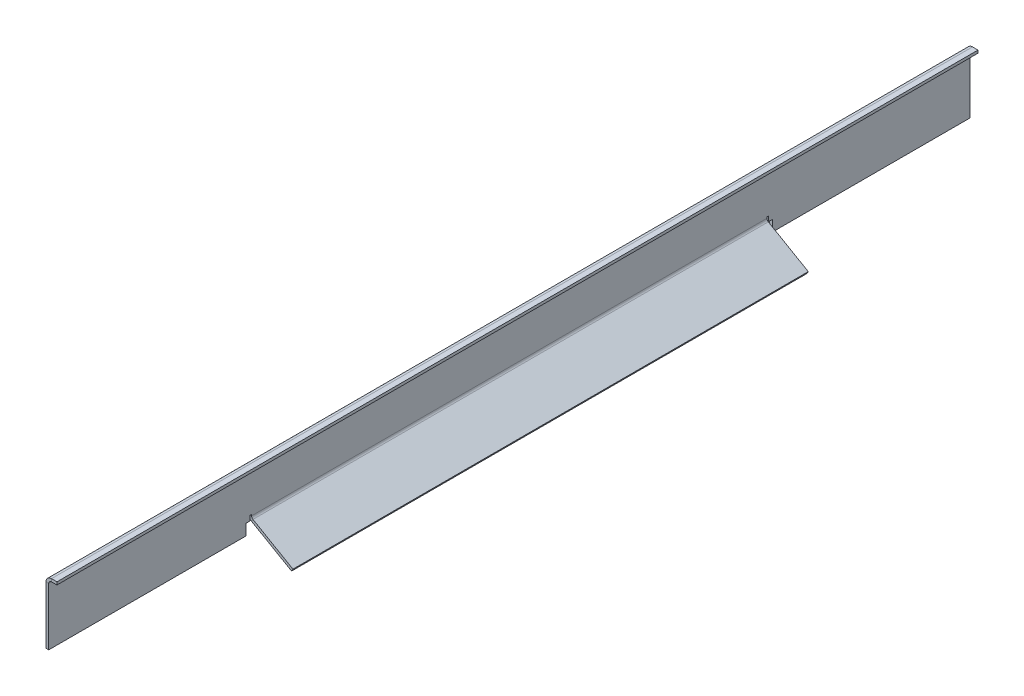
ISO-10303-21;
HEADER;
FILE_DESCRIPTION(('STEP AP214'),'2;1');
FILE_NAME('part.step','',(''),(''),'','','');
FILE_SCHEMA(('AUTOMOTIVE_DESIGN { 1 0 10303 214 1 1 1 1 }'));
ENDSEC;
DATA;
#1=APPLICATION_CONTEXT('core data for automotive mechanical design processes');
#2=APPLICATION_PROTOCOL_DEFINITION('international standard','automotive_design',2000,#1);
#3=PRODUCT_CONTEXT('',#1,'mechanical');
#4=PRODUCT('Part','Part','',(#3));
#5=PRODUCT_RELATED_PRODUCT_CATEGORY('part','',(#4));
#6=PRODUCT_DEFINITION_FORMATION('','',#4);
#7=PRODUCT_DEFINITION_CONTEXT('part definition',#1,'design');
#8=PRODUCT_DEFINITION('design','',#6,#7);
#9=PRODUCT_DEFINITION_SHAPE('','',#8);
#10=(LENGTH_UNIT() NAMED_UNIT(*) SI_UNIT(.MILLI.,.METRE.));
#11=(NAMED_UNIT(*) PLANE_ANGLE_UNIT() SI_UNIT($,.RADIAN.));
#12=(NAMED_UNIT(*) SI_UNIT($,.STERADIAN.) SOLID_ANGLE_UNIT());
#13=UNCERTAINTY_MEASURE_WITH_UNIT(LENGTH_MEASURE(1.E-05),#10,'distance_accuracy_value','');
#14=(GEOMETRIC_REPRESENTATION_CONTEXT(3) GLOBAL_UNCERTAINTY_ASSIGNED_CONTEXT((#13)) GLOBAL_UNIT_ASSIGNED_CONTEXT((#10,
#11,#12)) REPRESENTATION_CONTEXT('',''));
#15=CARTESIAN_POINT('',(0.,0.,0.));
#16=DIRECTION('',(0.,0.,1.));
#17=DIRECTION('',(1.,0.,0.));
#18=AXIS2_PLACEMENT_3D('',#15,#16,#17);
#19=CARTESIAN_POINT('',(-3.175,0.,0.));
#20=DIRECTION('',(-1.,0.,0.));
#21=DIRECTION('',(0.,0.,1.));
#22=AXIS2_PLACEMENT_3D('',#19,#20,#21);
#23=PLANE('',#22);
#24=DIRECTION('',(0.,-1.,0.));
#25=VECTOR('',#24,1.);
#26=CARTESIAN_POINT('',(-3.175,0.,0.));
#27=LINE('',#26,#25);
#28=CARTESIAN_POINT('',(-3.17500000000001,66.675,0.));
#29=VERTEX_POINT('',#28);
#30=CARTESIAN_POINT('',(-3.175,0.,0.));
#31=VERTEX_POINT('',#30);
#32=EDGE_CURVE('E402',#29,#31,#27,.T.);
#33=ORIENTED_EDGE('',*,*,#32,.F.);
#34=DIRECTION('',(0.,0.,1.));
#35=VECTOR('',#34,1.);
#36=CARTESIAN_POINT('',(-3.17500000000001,66.675,0.));
#37=LINE('',#36,#35);
#38=CARTESIAN_POINT('',(-3.175,66.675,-1066.8));
#39=VERTEX_POINT('',#38);
#40=EDGE_CURVE('E283',#29,#39,#37,.F.);
#41=ORIENTED_EDGE('',*,*,#40,.T.);
#42=DIRECTION('',(0.,1.,0.));
#43=VECTOR('',#42,1.);
#44=CARTESIAN_POINT('',(-3.175,0.,-1066.8));
#45=LINE('',#44,#43);
#46=CARTESIAN_POINT('',(-3.175,0.,-1066.8));
#47=VERTEX_POINT('',#46);
#48=EDGE_CURVE('E422',#47,#39,#45,.T.);
#49=ORIENTED_EDGE('',*,*,#48,.F.);
#50=DIRECTION('',(0.,0.,-1.));
#51=VECTOR('',#50,1.);
#52=CARTESIAN_POINT('',(-3.175,0.,-838.2));
#53=LINE('',#52,#51);
#54=CARTESIAN_POINT('',(-3.175,0.,-838.2));
#55=VERTEX_POINT('',#54);
#56=EDGE_CURVE('E419',#55,#47,#53,.T.);
#57=ORIENTED_EDGE('',*,*,#56,.F.);
#58=DIRECTION('',(0.,-1.,0.));
#59=VECTOR('',#58,1.);
#60=CARTESIAN_POINT('',(-3.175,0.,-838.2));
#61=LINE('',#60,#59);
#62=CARTESIAN_POINT('',(-3.175,12.7,-838.2));
#63=VERTEX_POINT('',#62);
#64=EDGE_CURVE('E416',#63,#55,#61,.T.);
#65=ORIENTED_EDGE('',*,*,#64,.F.);
#66=DIRECTION('',(0.,0.,-1.));
#67=VECTOR('',#66,1.);
#68=CARTESIAN_POINT('',(-3.175,12.7000000000004,-831.85));
#69=LINE('',#68,#67);
#70=CARTESIAN_POINT('',(-3.175,12.7000000000003,-833.4375));
#71=VERTEX_POINT('',#70);
#72=EDGE_CURVE('E414',#71,#63,#69,.T.);
#73=ORIENTED_EDGE('',*,*,#72,.F.);
#74=DIRECTION('',(0.,1.,0.));
#75=VECTOR('',#74,1.);
#76=CARTESIAN_POINT('',(-3.175,0.,-833.4375));
#77=LINE('',#76,#75);
#78=CARTESIAN_POINT('',(-3.175,18.5167613140312,-833.4375));
#79=VERTEX_POINT('',#78);
#80=EDGE_CURVE('E96',#71,#79,#77,.T.);
#81=ORIENTED_EDGE('',*,*,#80,.T.);
#82=DIRECTION('',(0.,0.,1.));
#83=VECTOR('',#82,1.);
#84=CARTESIAN_POINT('',(-3.175,18.5167613140312,0.));
#85=LINE('',#84,#83);
#86=CARTESIAN_POINT('',(-3.175,18.5167613140312,-831.85));
#87=VERTEX_POINT('',#86);
#88=EDGE_CURVE('E100',#79,#87,#85,.T.);
#89=ORIENTED_EDGE('',*,*,#88,.T.);
#90=DIRECTION('',(0.,-1.,0.));
#91=VECTOR('',#90,1.);
#92=CARTESIAN_POINT('',(-3.175,0.,-831.85));
#93=LINE('',#92,#91);
#94=CARTESIAN_POINT('',(-3.17499999999985,16.9292613140311,-831.85));
#95=VERTEX_POINT('',#94);
#96=EDGE_CURVE('E395',#87,#95,#93,.T.);
#97=ORIENTED_EDGE('',*,*,#96,.T.);
#98=DIRECTION('',(0.,0.,-1.));
#99=VECTOR('',#98,1.);
#100=CARTESIAN_POINT('',(-3.17499999999985,16.9292613140311,-831.85));
#101=LINE('',#100,#99);
#102=CARTESIAN_POINT('',(-3.175,16.9292613140312,-234.95));
#103=VERTEX_POINT('',#102);
#104=EDGE_CURVE('E337',#95,#103,#101,.F.);
#105=ORIENTED_EDGE('',*,*,#104,.T.);
#106=DIRECTION('',(0.,1.,0.));
#107=VECTOR('',#106,1.);
#108=CARTESIAN_POINT('',(-3.175,0.,-234.95));
#109=LINE('',#108,#107);
#110=CARTESIAN_POINT('',(-3.175,18.5167613140312,-234.95));
#111=VERTEX_POINT('',#110);
#112=EDGE_CURVE('E393',#103,#111,#109,.T.);
#113=ORIENTED_EDGE('',*,*,#112,.T.);
#114=DIRECTION('',(0.,0.,1.));
#115=VECTOR('',#114,1.);
#116=CARTESIAN_POINT('',(-3.175,18.5167613140312,0.));
#117=LINE('',#116,#115);
#118=CARTESIAN_POINT('',(-3.175,18.5167613140312,-233.3625));
#119=VERTEX_POINT('',#118);
#120=EDGE_CURVE('E391',#111,#119,#117,.T.);
#121=ORIENTED_EDGE('',*,*,#120,.T.);
#122=DIRECTION('',(0.,-1.,0.));
#123=VECTOR('',#122,1.);
#124=CARTESIAN_POINT('',(-3.175,0.,-233.3625));
#125=LINE('',#124,#123);
#126=CARTESIAN_POINT('',(-3.175,12.7,-233.3625));
#127=VERTEX_POINT('',#126);
#128=EDGE_CURVE('E363',#119,#127,#125,.T.);
#129=ORIENTED_EDGE('',*,*,#128,.T.);
#130=DIRECTION('',(0.,0.,-1.));
#131=VECTOR('',#130,1.);
#132=CARTESIAN_POINT('',(-3.175,12.7,-228.6));
#133=LINE('',#132,#131);
#134=CARTESIAN_POINT('',(-3.175,12.7,-228.6));
#135=VERTEX_POINT('',#134);
#136=EDGE_CURVE('E411',#135,#127,#133,.T.);
#137=ORIENTED_EDGE('',*,*,#136,.F.);
#138=DIRECTION('',(0.,1.,0.));
#139=VECTOR('',#138,1.);
#140=CARTESIAN_POINT('',(-3.175,0.,-228.6));
#141=LINE('',#140,#139);
#142=CARTESIAN_POINT('',(-3.175,0.,-228.6));
#143=VERTEX_POINT('',#142);
#144=EDGE_CURVE('E408',#143,#135,#141,.T.);
#145=ORIENTED_EDGE('',*,*,#144,.F.);
#146=DIRECTION('',(0.,0.,-1.));
#147=VECTOR('',#146,1.);
#148=CARTESIAN_POINT('',(-3.175,0.,0.));
#149=LINE('',#148,#147);
#150=EDGE_CURVE('E404',#31,#143,#149,.T.);
#151=ORIENTED_EDGE('',*,*,#150,.F.);
#152=EDGE_LOOP('',(#33,#41,#49,#57,#65,#73,#81,#89,#97,#105,#113,#121,#129,#137,#145,#151));
#153=FACE_BOUND('',#152,.T.);
#154=ADVANCED_FACE('F81',(#153),#23,.T.);
#155=CARTESIAN_POINT('',(0.,0.,0.));
#156=DIRECTION('',(-1.,0.,0.));
#157=DIRECTION('',(0.,0.,1.));
#158=AXIS2_PLACEMENT_3D('',#155,#156,#157);
#159=PLANE('',#158);
#160=DIRECTION('',(0.,0.,1.));
#161=VECTOR('',#160,1.);
#162=CARTESIAN_POINT('',(0.,66.675,0.));
#163=LINE('',#162,#161);
#164=CARTESIAN_POINT('',(0.,66.675,0.));
#165=VERTEX_POINT('',#164);
#166=CARTESIAN_POINT('',(0.,66.675,-1066.8));
#167=VERTEX_POINT('',#166);
#168=EDGE_CURVE('E296',#165,#167,#163,.F.);
#169=ORIENTED_EDGE('',*,*,#168,.F.);
#170=DIRECTION('',(0.,-1.,0.));
#171=VECTOR('',#170,1.);
#172=CARTESIAN_POINT('',(0.,0.,0.));
#173=LINE('',#172,#171);
#174=CARTESIAN_POINT('',(0.,0.,0.));
#175=VERTEX_POINT('',#174);
#176=EDGE_CURVE('E401',#165,#175,#173,.T.);
#177=ORIENTED_EDGE('',*,*,#176,.T.);
#178=DIRECTION('',(0.,0.,-1.));
#179=VECTOR('',#178,1.);
#180=CARTESIAN_POINT('',(0.,0.,0.));
#181=LINE('',#180,#179);
#182=CARTESIAN_POINT('',(0.,0.,-228.6));
#183=VERTEX_POINT('',#182);
#184=EDGE_CURVE('E427',#175,#183,#181,.T.);
#185=ORIENTED_EDGE('',*,*,#184,.T.);
#186=DIRECTION('',(0.,1.,0.));
#187=VECTOR('',#186,1.);
#188=CARTESIAN_POINT('',(0.,0.,-228.6));
#189=LINE('',#188,#187);
#190=CARTESIAN_POINT('',(0.,12.7,-228.6));
#191=VERTEX_POINT('',#190);
#192=EDGE_CURVE('E430',#183,#191,#189,.T.);
#193=ORIENTED_EDGE('',*,*,#192,.T.);
#194=DIRECTION('',(0.,0.,-1.));
#195=VECTOR('',#194,1.);
#196=CARTESIAN_POINT('',(0.,12.7,-228.6));
#197=LINE('',#196,#195);
#198=CARTESIAN_POINT('',(0.,12.7,-233.3625));
#199=VERTEX_POINT('',#198);
#200=EDGE_CURVE('E433',#191,#199,#197,.T.);
#201=ORIENTED_EDGE('',*,*,#200,.T.);
#202=DIRECTION('',(0.,-1.,0.));
#203=VECTOR('',#202,1.);
#204=CARTESIAN_POINT('',(0.,18.5167613140312,-233.3625));
#205=LINE('',#204,#203);
#206=CARTESIAN_POINT('',(0.,18.5167613140312,-233.3625));
#207=VERTEX_POINT('',#206);
#208=EDGE_CURVE('E376',#207,#199,#205,.T.);
#209=ORIENTED_EDGE('',*,*,#208,.F.);
#210=DIRECTION('',(0.,0.,1.));
#211=VECTOR('',#210,1.);
#212=CARTESIAN_POINT('',(0.,18.5167613140312,-234.95));
#213=LINE('',#212,#211);
#214=CARTESIAN_POINT('',(0.,18.5167613140312,-234.95));
#215=VERTEX_POINT('',#214);
#216=EDGE_CURVE('E372',#215,#207,#213,.T.);
#217=ORIENTED_EDGE('',*,*,#216,.F.);
#218=DIRECTION('',(0.,1.,0.));
#219=VECTOR('',#218,1.);
#220=CARTESIAN_POINT('',(0.,16.9292613140312,-234.95));
#221=LINE('',#220,#219);
#222=CARTESIAN_POINT('',(0.,16.9292613140312,-234.95));
#223=VERTEX_POINT('',#222);
#224=EDGE_CURVE('E369',#223,#215,#221,.T.);
#225=ORIENTED_EDGE('',*,*,#224,.F.);
#226=DIRECTION('',(0.,0.,-1.));
#227=VECTOR('',#226,1.);
#228=CARTESIAN_POINT('',(1.53523027623947E-13,16.9292613140312,-831.85));
#229=LINE('',#228,#227);
#230=CARTESIAN_POINT('',(1.53523027623947E-13,16.9292613140312,-831.85));
#231=VERTEX_POINT('',#230);
#232=EDGE_CURVE('E350',#231,#223,#229,.F.);
#233=ORIENTED_EDGE('',*,*,#232,.F.);
#234=DIRECTION('',(0.,-1.,0.));
#235=VECTOR('',#234,1.);
#236=CARTESIAN_POINT('',(1.53523027623947E-13,18.5167613140312,-831.85));
#237=LINE('',#236,#235);
#238=CARTESIAN_POINT('',(0.,18.5167613140312,-831.85));
#239=VERTEX_POINT('',#238);
#240=EDGE_CURVE('E365',#239,#231,#237,.T.);
#241=ORIENTED_EDGE('',*,*,#240,.F.);
#242=DIRECTION('',(0.,0.,1.));
#243=VECTOR('',#242,1.);
#244=CARTESIAN_POINT('',(1.53523027623947E-13,18.5167613140312,-833.4375));
#245=LINE('',#244,#243);
#246=CARTESIAN_POINT('',(0.,18.5167613140312,-833.4375));
#247=VERTEX_POINT('',#246);
#248=EDGE_CURVE('E360',#247,#239,#245,.T.);
#249=ORIENTED_EDGE('',*,*,#248,.F.);
#250=DIRECTION('',(0.,1.,0.));
#251=VECTOR('',#250,1.);
#252=CARTESIAN_POINT('',(0.,0.,-833.4375));
#253=LINE('',#252,#251);
#254=CARTESIAN_POINT('',(0.,12.7000000000003,-833.4375));
#255=VERTEX_POINT('',#254);
#256=EDGE_CURVE('E13',#255,#247,#253,.T.);
#257=ORIENTED_EDGE('',*,*,#256,.F.);
#258=DIRECTION('',(0.,0.,-1.));
#259=VECTOR('',#258,1.);
#260=CARTESIAN_POINT('',(0.,12.7000000000004,-831.85));
#261=LINE('',#260,#259);
#262=CARTESIAN_POINT('',(0.,12.7,-838.2));
#263=VERTEX_POINT('',#262);
#264=EDGE_CURVE('E435',#255,#263,#261,.T.);
#265=ORIENTED_EDGE('',*,*,#264,.T.);
#266=DIRECTION('',(0.,-1.,0.));
#267=VECTOR('',#266,1.);
#268=CARTESIAN_POINT('',(0.,0.,-838.2));
#269=LINE('',#268,#267);
#270=CARTESIAN_POINT('',(0.,0.,-838.2));
#271=VERTEX_POINT('',#270);
#272=EDGE_CURVE('E437',#263,#271,#269,.T.);
#273=ORIENTED_EDGE('',*,*,#272,.T.);
#274=DIRECTION('',(0.,0.,-1.));
#275=VECTOR('',#274,1.);
#276=CARTESIAN_POINT('',(0.,0.,-838.2));
#277=LINE('',#276,#275);
#278=CARTESIAN_POINT('',(0.,0.,-1066.8));
#279=VERTEX_POINT('',#278);
#280=EDGE_CURVE('E440',#271,#279,#277,.T.);
#281=ORIENTED_EDGE('',*,*,#280,.T.);
#282=DIRECTION('',(0.,1.,0.));
#283=VECTOR('',#282,1.);
#284=CARTESIAN_POINT('',(0.,0.,-1066.8));
#285=LINE('',#284,#283);
#286=EDGE_CURVE('E405',#279,#167,#285,.T.);
#287=ORIENTED_EDGE('',*,*,#286,.T.);
#288=EDGE_LOOP('',(#169,#177,#185,#193,#201,#209,#217,#225,#233,#241,#249,#257,#265,#273,#281,#287));
#289=FACE_BOUND('',#288,.T.);
#290=ADVANCED_FACE('F466',(#289),#159,.F.);
#291=CARTESIAN_POINT('',(-3.175,0.,0.));
#292=DIRECTION('',(0.,0.,1.));
#293=DIRECTION('',(1.,0.,0.));
#294=AXIS2_PLACEMENT_3D('',#291,#292,#293);
#295=PLANE('',#294);
#296=ORIENTED_EDGE('',*,*,#176,.F.);
#297=DIRECTION('',(-1.,0.,0.));
#298=VECTOR('',#297,1.);
#299=CARTESIAN_POINT('',(0.,66.675,0.));
#300=LINE('',#299,#298);
#301=EDGE_CURVE('E290',#165,#29,#300,.T.);
#302=ORIENTED_EDGE('',*,*,#301,.T.);
#303=ORIENTED_EDGE('',*,*,#32,.T.);
#304=DIRECTION('',(1.,0.,0.));
#305=VECTOR('',#304,1.);
#306=CARTESIAN_POINT('',(-3.175,0.,0.));
#307=LINE('',#306,#305);
#308=EDGE_CURVE('E425',#31,#175,#307,.T.);
#309=ORIENTED_EDGE('',*,*,#308,.T.);
#310=EDGE_LOOP('',(#296,#302,#303,#309));
#311=FACE_BOUND('',#310,.T.);
#312=ADVANCED_FACE('F83',(#311),#295,.T.);
#313=CARTESIAN_POINT('',(-3.175,12.7000000000004,-831.85));
#314=DIRECTION('',(0.,-1.,0.));
#315=DIRECTION('',(0.,0.,-1.));
#316=AXIS2_PLACEMENT_3D('',#313,#314,#315);
#317=PLANE('',#316);
#318=ORIENTED_EDGE('',*,*,#264,.F.);
#319=DIRECTION('',(-1.,0.,0.));
#320=VECTOR('',#319,1.);
#321=CARTESIAN_POINT('',(-3.175,12.7000000000003,-833.4375));
#322=LINE('',#321,#320);
#323=EDGE_CURVE('E399',#255,#71,#322,.T.);
#324=ORIENTED_EDGE('',*,*,#323,.T.);
#325=ORIENTED_EDGE('',*,*,#72,.T.);
#326=DIRECTION('',(1.,0.,0.));
#327=VECTOR('',#326,1.);
#328=CARTESIAN_POINT('',(-3.175,12.7,-838.2));
#329=LINE('',#328,#327);
#330=EDGE_CURVE('E448',#63,#263,#329,.T.);
#331=ORIENTED_EDGE('',*,*,#330,.T.);
#332=EDGE_LOOP('',(#318,#324,#325,#331));
#333=FACE_BOUND('',#332,.T.);
#334=ADVANCED_FACE('F521',(#333),#317,.T.);
#335=CARTESIAN_POINT('',(-3.175,12.7,-228.6));
#336=DIRECTION('',(0.,-1.,0.));
#337=DIRECTION('',(0.,0.,-1.));
#338=AXIS2_PLACEMENT_3D('',#335,#336,#337);
#339=PLANE('',#338);
#340=ORIENTED_EDGE('',*,*,#136,.T.);
#341=DIRECTION('',(1.,0.,0.));
#342=VECTOR('',#341,1.);
#343=CARTESIAN_POINT('',(-3.175,12.7,-233.3625));
#344=LINE('',#343,#342);
#345=EDGE_CURVE('E388',#127,#199,#344,.T.);
#346=ORIENTED_EDGE('',*,*,#345,.T.);
#347=ORIENTED_EDGE('',*,*,#200,.F.);
#348=DIRECTION('',(1.,0.,0.));
#349=VECTOR('',#348,1.);
#350=CARTESIAN_POINT('',(-3.175,12.7,-228.6));
#351=LINE('',#350,#349);
#352=EDGE_CURVE('E451',#135,#191,#351,.T.);
#353=ORIENTED_EDGE('',*,*,#352,.F.);
#354=EDGE_LOOP('',(#340,#346,#347,#353));
#355=FACE_BOUND('',#354,.T.);
#356=ADVANCED_FACE('F512',(#355),#339,.T.);
#357=CARTESIAN_POINT('',(-3.175,0.,-1066.8));
#358=DIRECTION('',(0.,0.,-1.));
#359=DIRECTION('',(-1.,0.,0.));
#360=AXIS2_PLACEMENT_3D('',#357,#358,#359);
#361=PLANE('',#360);
#362=DIRECTION('',(-1.,0.,0.));
#363=VECTOR('',#362,1.);
#364=CARTESIAN_POINT('',(0.,66.675,-1066.8));
#365=LINE('',#364,#363);
#366=EDGE_CURVE('E301',#167,#39,#365,.T.);
#367=ORIENTED_EDGE('',*,*,#366,.F.);
#368=ORIENTED_EDGE('',*,*,#286,.F.);
#369=DIRECTION('',(1.,0.,0.));
#370=VECTOR('',#369,1.);
#371=CARTESIAN_POINT('',(-3.175,0.,-1066.8));
#372=LINE('',#371,#370);
#373=EDGE_CURVE('E89',#47,#279,#372,.T.);
#374=ORIENTED_EDGE('',*,*,#373,.F.);
#375=ORIENTED_EDGE('',*,*,#48,.T.);
#376=EDGE_LOOP('',(#367,#368,#374,#375));
#377=FACE_BOUND('',#376,.T.);
#378=ADVANCED_FACE('F477',(#377),#361,.T.);
#379=CARTESIAN_POINT('',(-3.175,0.,-838.2));
#380=DIRECTION('',(0.,-1.,0.));
#381=DIRECTION('',(0.,0.,-1.));
#382=AXIS2_PLACEMENT_3D('',#379,#380,#381);
#383=PLANE('',#382);
#384=ORIENTED_EDGE('',*,*,#280,.F.);
#385=DIRECTION('',(1.,0.,0.));
#386=VECTOR('',#385,1.);
#387=CARTESIAN_POINT('',(-3.175,0.,-838.2));
#388=LINE('',#387,#386);
#389=EDGE_CURVE('E446',#55,#271,#388,.T.);
#390=ORIENTED_EDGE('',*,*,#389,.F.);
#391=ORIENTED_EDGE('',*,*,#56,.T.);
#392=ORIENTED_EDGE('',*,*,#373,.T.);
#393=EDGE_LOOP('',(#384,#390,#391,#392));
#394=FACE_BOUND('',#393,.T.);
#395=ADVANCED_FACE('F511',(#394),#383,.T.);
#396=CARTESIAN_POINT('',(-3.175,0.,-838.2));
#397=DIRECTION('',(0.,0.,1.));
#398=DIRECTION('',(1.,0.,0.));
#399=AXIS2_PLACEMENT_3D('',#396,#397,#398);
#400=PLANE('',#399);
#401=ORIENTED_EDGE('',*,*,#272,.F.);
#402=ORIENTED_EDGE('',*,*,#330,.F.);
#403=ORIENTED_EDGE('',*,*,#64,.T.);
#404=ORIENTED_EDGE('',*,*,#389,.T.);
#405=EDGE_LOOP('',(#401,#402,#403,#404));
#406=FACE_BOUND('',#405,.T.);
#407=ADVANCED_FACE('F515',(#406),#400,.T.);
#408=CARTESIAN_POINT('',(-3.175,0.,-228.6));
#409=DIRECTION('',(0.,0.,-1.));
#410=DIRECTION('',(-1.,0.,0.));
#411=AXIS2_PLACEMENT_3D('',#408,#409,#410);
#412=PLANE('',#411);
#413=ORIENTED_EDGE('',*,*,#192,.F.);
#414=DIRECTION('',(1.,0.,0.));
#415=VECTOR('',#414,1.);
#416=CARTESIAN_POINT('',(-3.175,0.,-228.6));
#417=LINE('',#416,#415);
#418=EDGE_CURVE('E453',#143,#183,#417,.T.);
#419=ORIENTED_EDGE('',*,*,#418,.F.);
#420=ORIENTED_EDGE('',*,*,#144,.T.);
#421=ORIENTED_EDGE('',*,*,#352,.T.);
#422=EDGE_LOOP('',(#413,#419,#420,#421));
#423=FACE_BOUND('',#422,.T.);
#424=ADVANCED_FACE('F519',(#423),#412,.T.);
#425=CARTESIAN_POINT('',(-3.175,0.,0.));
#426=DIRECTION('',(0.,-1.,0.));
#427=DIRECTION('',(0.,0.,-1.));
#428=AXIS2_PLACEMENT_3D('',#425,#426,#427);
#429=PLANE('',#428);
#430=ORIENTED_EDGE('',*,*,#184,.F.);
#431=ORIENTED_EDGE('',*,*,#308,.F.);
#432=ORIENTED_EDGE('',*,*,#150,.T.);
#433=ORIENTED_EDGE('',*,*,#418,.T.);
#434=EDGE_LOOP('',(#430,#431,#432,#433));
#435=FACE_BOUND('',#434,.T.);
#436=ADVANCED_FACE('F462',(#435),#429,.T.);
#437=CARTESIAN_POINT('',(1.53523027623947E-13,11.43,-833.4375));
#438=DIRECTION('',(0.,0.,1.));
#439=DIRECTION('',(1.,0.,0.));
#440=AXIS2_PLACEMENT_3D('',#437,#438,#439);
#441=PLANE('',#440);
#442=ORIENTED_EDGE('',*,*,#323,.F.);
#443=ORIENTED_EDGE('',*,*,#256,.T.);
#444=DIRECTION('',(-1.,0.,0.));
#445=VECTOR('',#444,1.);
#446=CARTESIAN_POINT('',(1.53523027623947E-13,18.5167613140312,-833.4375));
#447=LINE('',#446,#445);
#448=EDGE_CURVE('E364',#247,#79,#447,.T.);
#449=ORIENTED_EDGE('',*,*,#448,.T.);
#450=ORIENTED_EDGE('',*,*,#80,.F.);
#451=EDGE_LOOP('',(#442,#443,#449,#450));
#452=FACE_BOUND('',#451,.T.);
#453=ADVANCED_FACE('F506',(#452),#441,.T.);
#454=CARTESIAN_POINT('',(1.53523027623947E-13,18.5167613140312,-833.4375));
#455=DIRECTION('',(0.,-1.,0.));
#456=DIRECTION('',(0.,0.,-1.));
#457=AXIS2_PLACEMENT_3D('',#454,#455,#456);
#458=PLANE('',#457);
#459=ORIENTED_EDGE('',*,*,#88,.F.);
#460=ORIENTED_EDGE('',*,*,#448,.F.);
#461=ORIENTED_EDGE('',*,*,#248,.T.);
#462=DIRECTION('',(-1.,0.,0.));
#463=VECTOR('',#462,1.);
#464=CARTESIAN_POINT('',(1.53523027623947E-13,18.5167613140312,-831.85));
#465=LINE('',#464,#463);
#466=EDGE_CURVE('E368',#239,#87,#465,.T.);
#467=ORIENTED_EDGE('',*,*,#466,.T.);
#468=EDGE_LOOP('',(#459,#460,#461,#467));
#469=FACE_BOUND('',#468,.T.);
#470=ADVANCED_FACE('F534',(#469),#458,.T.);
#471=CARTESIAN_POINT('',(1.53523027623947E-13,18.5167613140312,-831.85));
#472=DIRECTION('',(0.,0.,-1.));
#473=DIRECTION('',(-1.,0.,0.));
#474=AXIS2_PLACEMENT_3D('',#471,#472,#473);
#475=PLANE('',#474);
#476=ORIENTED_EDGE('',*,*,#96,.F.);
#477=ORIENTED_EDGE('',*,*,#466,.F.);
#478=ORIENTED_EDGE('',*,*,#240,.T.);
#479=DIRECTION('',(-1.,0.,0.));
#480=VECTOR('',#479,1.);
#481=CARTESIAN_POINT('',(1.53523027623947E-13,16.9292613140312,-831.85));
#482=LINE('',#481,#480);
#483=EDGE_CURVE('E344',#231,#95,#482,.T.);
#484=ORIENTED_EDGE('',*,*,#483,.T.);
#485=EDGE_LOOP('',(#476,#477,#478,#484));
#486=FACE_BOUND('',#485,.T.);
#487=ADVANCED_FACE('F539',(#486),#475,.T.);
#488=CARTESIAN_POINT('',(0.,16.9292613140312,-234.95));
#489=DIRECTION('',(0.,0.,1.));
#490=DIRECTION('',(1.,0.,0.));
#491=AXIS2_PLACEMENT_3D('',#488,#489,#490);
#492=PLANE('',#491);
#493=ORIENTED_EDGE('',*,*,#112,.F.);
#494=DIRECTION('',(-1.,0.,0.));
#495=VECTOR('',#494,1.);
#496=CARTESIAN_POINT('',(0.,16.9292613140312,-234.95));
#497=LINE('',#496,#495);
#498=EDGE_CURVE('E354',#223,#103,#497,.T.);
#499=ORIENTED_EDGE('',*,*,#498,.F.);
#500=ORIENTED_EDGE('',*,*,#224,.T.);
#501=DIRECTION('',(-1.,0.,0.));
#502=VECTOR('',#501,1.);
#503=CARTESIAN_POINT('',(0.,18.5167613140312,-234.95));
#504=LINE('',#503,#502);
#505=EDGE_CURVE('E375',#215,#111,#504,.T.);
#506=ORIENTED_EDGE('',*,*,#505,.T.);
#507=EDGE_LOOP('',(#493,#499,#500,#506));
#508=FACE_BOUND('',#507,.T.);
#509=ADVANCED_FACE('F556',(#508),#492,.T.);
#510=CARTESIAN_POINT('',(0.,18.5167613140312,-234.95));
#511=DIRECTION('',(0.,-1.,0.));
#512=DIRECTION('',(0.,0.,-1.));
#513=AXIS2_PLACEMENT_3D('',#510,#511,#512);
#514=PLANE('',#513);
#515=ORIENTED_EDGE('',*,*,#120,.F.);
#516=ORIENTED_EDGE('',*,*,#505,.F.);
#517=ORIENTED_EDGE('',*,*,#216,.T.);
#518=DIRECTION('',(-1.,0.,0.));
#519=VECTOR('',#518,1.);
#520=CARTESIAN_POINT('',(0.,18.5167613140312,-233.3625));
#521=LINE('',#520,#519);
#522=EDGE_CURVE('E357',#207,#119,#521,.T.);
#523=ORIENTED_EDGE('',*,*,#522,.T.);
#524=EDGE_LOOP('',(#515,#516,#517,#523));
#525=FACE_BOUND('',#524,.T.);
#526=ADVANCED_FACE('F560',(#525),#514,.T.);
#527=CARTESIAN_POINT('',(0.,18.5167613140312,-233.3625));
#528=DIRECTION('',(0.,0.,-1.));
#529=DIRECTION('',(-1.,0.,0.));
#530=AXIS2_PLACEMENT_3D('',#527,#528,#529);
#531=PLANE('',#530);
#532=ORIENTED_EDGE('',*,*,#345,.F.);
#533=ORIENTED_EDGE('',*,*,#128,.F.);
#534=ORIENTED_EDGE('',*,*,#522,.F.);
#535=ORIENTED_EDGE('',*,*,#208,.T.);
#536=EDGE_LOOP('',(#532,#533,#534,#535));
#537=FACE_BOUND('',#536,.T.);
#538=ADVANCED_FACE('F566',(#537),#531,.T.);
#539=CARTESIAN_POINT('',(3.17499999999998,16.9292613140312,-234.95));
#540=DIRECTION('',(0.,0.,1.));
#541=DIRECTION('',(1.,0.,0.));
#542=AXIS2_PLACEMENT_3D('',#539,#540,#541);
#543=PLANE('',#542);
#544=DIRECTION('',(0.500000000000004,0.866025403784436,0.));
#545=VECTOR('',#544,1.);
#546=CARTESIAN_POINT('',(0.,11.4300000000001,-234.95));
#547=LINE('',#546,#545);
#548=CARTESIAN_POINT('',(1.5875,14.1796306570156,-234.95));
#549=VERTEX_POINT('',#548);
#550=CARTESIAN_POINT('',(0.,11.4300000000001,-234.95));
#551=VERTEX_POINT('',#550);
#552=EDGE_CURVE('E304',#549,#551,#547,.F.);
#553=ORIENTED_EDGE('',*,*,#552,.F.);
#554=CARTESIAN_POINT('',(3.17499999999998,16.9292613140312,-234.95));
#555=DIRECTION('',(0.,0.,-1.));
#556=DIRECTION('',(-1.,0.,0.));
#557=AXIS2_PLACEMENT_3D('',#554,#555,#556);
#558=CIRCLE('',#557,3.17499999999995);
#559=EDGE_CURVE('E347',#223,#549,#558,.F.);
#560=ORIENTED_EDGE('',*,*,#559,.F.);
#561=ORIENTED_EDGE('',*,*,#498,.T.);
#562=CARTESIAN_POINT('',(3.17499999999998,16.9292613140312,-234.95));
#563=DIRECTION('',(0.,0.,-1.));
#564=DIRECTION('',(-1.,0.,0.));
#565=AXIS2_PLACEMENT_3D('',#562,#563,#564);
#566=CIRCLE('',#565,6.34999999999995);
#567=EDGE_CURVE('E340',#103,#551,#566,.F.);
#568=ORIENTED_EDGE('',*,*,#567,.T.);
#569=EDGE_LOOP('',(#553,#560,#561,#568));
#570=FACE_BOUND('',#569,.T.);
#571=ADVANCED_FACE('F575',(#570),#543,.T.);
#572=CARTESIAN_POINT('',(3.1750000000001,16.9292613140312,-831.85));
#573=DIRECTION('',(0.,0.,1.));
#574=DIRECTION('',(1.,0.,0.));
#575=AXIS2_PLACEMENT_3D('',#572,#573,#574);
#576=PLANE('',#575);
#577=CARTESIAN_POINT('',(3.1750000000001,16.9292613140312,-831.85));
#578=DIRECTION('',(0.,0.,-1.));
#579=DIRECTION('',(-1.,0.,0.));
#580=AXIS2_PLACEMENT_3D('',#577,#578,#579);
#581=CIRCLE('',#580,3.17499999999995);
#582=CARTESIAN_POINT('',(1.58750000000012,14.1796306570156,-831.85));
#583=VERTEX_POINT('',#582);
#584=EDGE_CURVE('E310',#583,#231,#581,.T.);
#585=ORIENTED_EDGE('',*,*,#584,.F.);
#586=DIRECTION('',(0.500000000000004,0.866025403784436,0.));
#587=VECTOR('',#586,1.);
#588=CARTESIAN_POINT('',(1.58750000000007,14.1796306570155,-831.85));
#589=LINE('',#588,#587);
#590=CARTESIAN_POINT('',(0.,11.43,-831.85));
#591=VERTEX_POINT('',#590);
#592=EDGE_CURVE('E330',#583,#591,#589,.F.);
#593=ORIENTED_EDGE('',*,*,#592,.T.);
#594=CARTESIAN_POINT('',(3.1750000000001,16.9292613140312,-831.85));
#595=DIRECTION('',(0.,0.,-1.));
#596=DIRECTION('',(-1.,0.,0.));
#597=AXIS2_PLACEMENT_3D('',#594,#595,#596);
#598=CIRCLE('',#597,6.34999999999995);
#599=EDGE_CURVE('E341',#591,#95,#598,.T.);
#600=ORIENTED_EDGE('',*,*,#599,.T.);
#601=ORIENTED_EDGE('',*,*,#483,.F.);
#602=EDGE_LOOP('',(#585,#593,#600,#601));
#603=FACE_BOUND('',#602,.T.);
#604=ADVANCED_FACE('F595',(#603),#576,.F.);
#605=CARTESIAN_POINT('',(3.1750000000001,16.9292613140312,-831.85));
#606=DIRECTION('',(0.,0.,-1.));
#607=DIRECTION('',(-0.500000000000004,-0.866025403784436,0.));
#608=AXIS2_PLACEMENT_3D('',#605,#606,#607);
#609=CYLINDRICAL_SURFACE('',#608,6.34999999999995);
#610=ORIENTED_EDGE('',*,*,#104,.F.);
#611=ORIENTED_EDGE('',*,*,#599,.F.);
#612=DIRECTION('',(0.,0.,-1.));
#613=VECTOR('',#612,1.);
#614=CARTESIAN_POINT('',(0.,11.4300000000001,-234.95));
#615=LINE('',#614,#613);
#616=EDGE_CURVE('E328',#591,#551,#615,.F.);
#617=ORIENTED_EDGE('',*,*,#616,.T.);
#618=ORIENTED_EDGE('',*,*,#567,.F.);
#619=EDGE_LOOP('',(#610,#611,#617,#618));
#620=FACE_BOUND('',#619,.T.);
#621=ADVANCED_FACE('F605',(#620),#609,.T.);
#622=CARTESIAN_POINT('',(3.1750000000001,16.9292613140312,-831.85));
#623=DIRECTION('',(0.,0.,-1.));
#624=DIRECTION('',(-0.500000000000004,-0.866025403784436,0.));
#625=AXIS2_PLACEMENT_3D('',#622,#623,#624);
#626=CYLINDRICAL_SURFACE('',#625,3.17499999999995);
#627=ORIENTED_EDGE('',*,*,#232,.T.);
#628=ORIENTED_EDGE('',*,*,#559,.T.);
#629=DIRECTION('',(0.,0.,-1.));
#630=VECTOR('',#629,1.);
#631=CARTESIAN_POINT('',(1.58749999999999,14.1796306570156,-234.95));
#632=LINE('',#631,#630);
#633=EDGE_CURVE('E333',#549,#583,#632,.T.);
#634=ORIENTED_EDGE('',*,*,#633,.T.);
#635=ORIENTED_EDGE('',*,*,#584,.T.);
#636=EDGE_LOOP('',(#627,#628,#634,#635));
#637=FACE_BOUND('',#636,.T.);
#638=ADVANCED_FACE('F571',(#637),#626,.F.);
#639=CARTESIAN_POINT('',(46.3183518262805,-15.3119128953232,-831.85));
#640=DIRECTION('',(0.,0.,1.));
#641=DIRECTION('',(0.,-1.,0.));
#642=AXIS2_PLACEMENT_3D('',#639,#640,#641);
#643=PLANE('',#642);
#644=ORIENTED_EDGE('',*,*,#592,.F.);
#645=DIRECTION('',(-0.866025403784436,0.500000000000004,0.));
#646=VECTOR('',#645,1.);
#647=CARTESIAN_POINT('',(47.9058518262806,-12.5622822383076,-831.85));
#648=LINE('',#647,#646);
#649=CARTESIAN_POINT('',(47.9058518262806,-12.5622822383076,-831.85));
#650=VERTEX_POINT('',#649);
#651=EDGE_CURVE('E326',#583,#650,#648,.F.);
#652=ORIENTED_EDGE('',*,*,#651,.T.);
#653=DIRECTION('',(0.500000000000004,0.866025403784436,0.));
#654=VECTOR('',#653,1.);
#655=CARTESIAN_POINT('',(46.3183518262805,-15.3119128953232,-831.85));
#656=LINE('',#655,#654);
#657=CARTESIAN_POINT('',(46.3183518262805,-15.3119128953232,-831.85));
#658=VERTEX_POINT('',#657);
#659=EDGE_CURVE('E307',#658,#650,#656,.T.);
#660=ORIENTED_EDGE('',*,*,#659,.F.);
#661=DIRECTION('',(0.866025403784436,-0.500000000000004,0.));
#662=VECTOR('',#661,1.);
#663=CARTESIAN_POINT('',(3.36183518262808,9.4890435523385,-831.85));
#664=LINE('',#663,#662);
#665=EDGE_CURVE('E319',#591,#658,#664,.T.);
#666=ORIENTED_EDGE('',*,*,#665,.F.);
#667=EDGE_LOOP('',(#644,#652,#660,#666));
#668=FACE_BOUND('',#667,.T.);
#669=ADVANCED_FACE('F597',(#668),#643,.F.);
#670=CARTESIAN_POINT('',(-1.58750000000001,12.3465435523386,-234.95));
#671=DIRECTION('',(0.,0.,-1.));
#672=DIRECTION('',(0.,1.,0.));
#673=AXIS2_PLACEMENT_3D('',#670,#671,#672);
#674=PLANE('',#673);
#675=ORIENTED_EDGE('',*,*,#552,.T.);
#676=DIRECTION('',(-0.866025403784436,0.500000000000004,0.));
#677=VECTOR('',#676,1.);
#678=CARTESIAN_POINT('',(3.3618351826281,9.48904355233853,-234.95));
#679=LINE('',#678,#677);
#680=CARTESIAN_POINT('',(46.3183518262806,-15.3119128953231,-234.95));
#681=VERTEX_POINT('',#680);
#682=EDGE_CURVE('E314',#681,#551,#679,.T.);
#683=ORIENTED_EDGE('',*,*,#682,.F.);
#684=DIRECTION('',(0.500000000000004,0.866025403784436,0.));
#685=VECTOR('',#684,1.);
#686=CARTESIAN_POINT('',(46.3183518262805,-15.3119128953231,-234.95));
#687=LINE('',#686,#685);
#688=CARTESIAN_POINT('',(47.9058518262806,-12.5622822383075,-234.95));
#689=VERTEX_POINT('',#688);
#690=EDGE_CURVE('E311',#681,#689,#687,.T.);
#691=ORIENTED_EDGE('',*,*,#690,.T.);
#692=DIRECTION('',(0.866025403784436,-0.500000000000004,0.));
#693=VECTOR('',#692,1.);
#694=CARTESIAN_POINT('',(0.,15.0961742093542,-234.95));
#695=LINE('',#694,#693);
#696=EDGE_CURVE('E321',#689,#549,#695,.F.);
#697=ORIENTED_EDGE('',*,*,#696,.T.);
#698=EDGE_LOOP('',(#675,#683,#691,#697));
#699=FACE_BOUND('',#698,.T.);
#700=ADVANCED_FACE('F578',(#699),#674,.F.);
#701=CARTESIAN_POINT('',(3.36183518262811,9.48904355233855,0.));
#702=DIRECTION('',(0.500000000000004,0.866025403784436,0.));
#703=DIRECTION('',(-0.866025403784436,0.500000000000004,0.));
#704=AXIS2_PLACEMENT_3D('',#701,#702,#703);
#705=PLANE('',#704);
#706=ORIENTED_EDGE('',*,*,#616,.F.);
#707=ORIENTED_EDGE('',*,*,#665,.T.);
#708=DIRECTION('',(0.,0.,1.));
#709=VECTOR('',#708,1.);
#710=CARTESIAN_POINT('',(46.3183518262805,-15.3119128953231,0.));
#711=LINE('',#710,#709);
#712=EDGE_CURVE('E317',#658,#681,#711,.T.);
#713=ORIENTED_EDGE('',*,*,#712,.T.);
#714=ORIENTED_EDGE('',*,*,#682,.T.);
#715=EDGE_LOOP('',(#706,#707,#713,#714));
#716=FACE_BOUND('',#715,.T.);
#717=ADVANCED_FACE('F582',(#716),#705,.F.);
#718=CARTESIAN_POINT('',(4.94933518262812,12.2386742093541,0.));
#719=DIRECTION('',(0.500000000000004,0.866025403784436,0.));
#720=DIRECTION('',(-0.866025403784436,0.500000000000004,0.));
#721=AXIS2_PLACEMENT_3D('',#718,#719,#720);
#722=PLANE('',#721);
#723=ORIENTED_EDGE('',*,*,#651,.F.);
#724=ORIENTED_EDGE('',*,*,#633,.F.);
#725=ORIENTED_EDGE('',*,*,#696,.F.);
#726=DIRECTION('',(0.,0.,-1.));
#727=VECTOR('',#726,1.);
#728=CARTESIAN_POINT('',(47.9058518262806,-12.5622822383075,-234.95));
#729=LINE('',#728,#727);
#730=EDGE_CURVE('E324',#650,#689,#729,.F.);
#731=ORIENTED_EDGE('',*,*,#730,.F.);
#732=EDGE_LOOP('',(#723,#724,#725,#731));
#733=FACE_BOUND('',#732,.T.);
#734=ADVANCED_FACE('F592',(#733),#722,.T.);
#735=CARTESIAN_POINT('',(46.3183518262805,-15.3119128953231,-234.95));
#736=DIRECTION('',(-0.866025403784436,0.500000000000004,0.));
#737=DIRECTION('',(-0.500000000000004,-0.866025403784436,0.));
#738=AXIS2_PLACEMENT_3D('',#735,#736,#737);
#739=PLANE('',#738);
#740=ORIENTED_EDGE('',*,*,#730,.T.);
#741=ORIENTED_EDGE('',*,*,#690,.F.);
#742=ORIENTED_EDGE('',*,*,#712,.F.);
#743=ORIENTED_EDGE('',*,*,#659,.T.);
#744=EDGE_LOOP('',(#740,#741,#742,#743));
#745=FACE_BOUND('',#744,.T.);
#746=ADVANCED_FACE('F588',(#745),#739,.F.);
#747=CARTESIAN_POINT('',(3.17499999999999,66.675,-1066.8));
#748=DIRECTION('',(0.,0.,-1.));
#749=DIRECTION('',(-1.,0.,0.));
#750=AXIS2_PLACEMENT_3D('',#747,#748,#749);
#751=PLANE('',#750);
#752=DIRECTION('',(0.,-1.,0.));
#753=VECTOR('',#752,1.);
#754=CARTESIAN_POINT('',(3.17499999999997,73.025,-1066.8));
#755=LINE('',#754,#753);
#756=CARTESIAN_POINT('',(3.17499999999998,69.85,-1066.8));
#757=VERTEX_POINT('',#756);
#758=CARTESIAN_POINT('',(3.17499999999997,73.025,-1066.8));
#759=VERTEX_POINT('',#758);
#760=EDGE_CURVE('E266',#757,#759,#755,.F.);
#761=ORIENTED_EDGE('',*,*,#760,.F.);
#762=CARTESIAN_POINT('',(3.17499999999999,66.675,-1066.8));
#763=DIRECTION('',(0.,0.,1.));
#764=DIRECTION('',(1.,0.,0.));
#765=AXIS2_PLACEMENT_3D('',#762,#763,#764);
#766=CIRCLE('',#765,3.175);
#767=EDGE_CURVE('E293',#167,#757,#766,.F.);
#768=ORIENTED_EDGE('',*,*,#767,.F.);
#769=ORIENTED_EDGE('',*,*,#366,.T.);
#770=CARTESIAN_POINT('',(3.17499999999999,66.675,-1066.8));
#771=DIRECTION('',(0.,0.,1.));
#772=DIRECTION('',(1.,0.,0.));
#773=AXIS2_PLACEMENT_3D('',#770,#771,#772);
#774=CIRCLE('',#773,6.35);
#775=EDGE_CURVE('E286',#39,#759,#774,.F.);
#776=ORIENTED_EDGE('',*,*,#775,.T.);
#777=EDGE_LOOP('',(#761,#768,#769,#776));
#778=FACE_BOUND('',#777,.T.);
#779=ADVANCED_FACE('F475',(#778),#751,.T.);
#780=CARTESIAN_POINT('',(3.17499999999999,66.675,0.));
#781=DIRECTION('',(0.,0.,-1.));
#782=DIRECTION('',(-1.,0.,0.));
#783=AXIS2_PLACEMENT_3D('',#780,#781,#782);
#784=PLANE('',#783);
#785=CARTESIAN_POINT('',(3.17499999999999,66.675,0.));
#786=DIRECTION('',(0.,0.,1.));
#787=DIRECTION('',(1.,0.,0.));
#788=AXIS2_PLACEMENT_3D('',#785,#786,#787);
#789=CIRCLE('',#788,3.175);
#790=CARTESIAN_POINT('',(3.17499999999998,69.85,0.));
#791=VERTEX_POINT('',#790);
#792=EDGE_CURVE('E298',#791,#165,#789,.T.);
#793=ORIENTED_EDGE('',*,*,#792,.F.);
#794=DIRECTION('',(0.,-1.,0.));
#795=VECTOR('',#794,1.);
#796=CARTESIAN_POINT('',(3.17499999999997,69.85,0.));
#797=LINE('',#796,#795);
#798=CARTESIAN_POINT('',(3.17499999999996,73.025,0.));
#799=VERTEX_POINT('',#798);
#800=EDGE_CURVE('E277',#791,#799,#797,.F.);
#801=ORIENTED_EDGE('',*,*,#800,.T.);
#802=CARTESIAN_POINT('',(3.17499999999999,66.675,0.));
#803=DIRECTION('',(0.,0.,1.));
#804=DIRECTION('',(1.,0.,0.));
#805=AXIS2_PLACEMENT_3D('',#802,#803,#804);
#806=CIRCLE('',#805,6.35);
#807=EDGE_CURVE('E287',#799,#29,#806,.T.);
#808=ORIENTED_EDGE('',*,*,#807,.T.);
#809=ORIENTED_EDGE('',*,*,#301,.F.);
#810=EDGE_LOOP('',(#793,#801,#808,#809));
#811=FACE_BOUND('',#810,.T.);
#812=ADVANCED_FACE('F483',(#811),#784,.F.);
#813=CARTESIAN_POINT('',(3.17499999999999,66.675,0.));
#814=DIRECTION('',(0.,0.,1.));
#815=DIRECTION('',(0.,1.,0.));
#816=AXIS2_PLACEMENT_3D('',#813,#814,#815);
#817=CYLINDRICAL_SURFACE('',#816,6.35);
#818=ORIENTED_EDGE('',*,*,#40,.F.);
#819=ORIENTED_EDGE('',*,*,#807,.F.);
#820=DIRECTION('',(0.,0.,1.));
#821=VECTOR('',#820,1.);
#822=CARTESIAN_POINT('',(3.17499999999997,73.025,-1066.8));
#823=LINE('',#822,#821);
#824=EDGE_CURVE('E275',#799,#759,#823,.F.);
#825=ORIENTED_EDGE('',*,*,#824,.T.);
#826=ORIENTED_EDGE('',*,*,#775,.F.);
#827=EDGE_LOOP('',(#818,#819,#825,#826));
#828=FACE_BOUND('',#827,.T.);
#829=ADVANCED_FACE('F481',(#828),#817,.T.);
#830=CARTESIAN_POINT('',(3.17499999999999,66.675,0.));
#831=DIRECTION('',(0.,0.,1.));
#832=DIRECTION('',(0.,1.,0.));
#833=AXIS2_PLACEMENT_3D('',#830,#831,#832);
#834=CYLINDRICAL_SURFACE('',#833,3.175);
#835=ORIENTED_EDGE('',*,*,#168,.T.);
#836=ORIENTED_EDGE('',*,*,#767,.T.);
#837=DIRECTION('',(0.,0.,1.));
#838=VECTOR('',#837,1.);
#839=CARTESIAN_POINT('',(3.17499999999998,69.85,-1066.8));
#840=LINE('',#839,#838);
#841=EDGE_CURVE('E280',#757,#791,#840,.T.);
#842=ORIENTED_EDGE('',*,*,#841,.T.);
#843=ORIENTED_EDGE('',*,*,#792,.T.);
#844=EDGE_LOOP('',(#835,#836,#842,#843));
#845=FACE_BOUND('',#844,.T.);
#846=ADVANCED_FACE('F470',(#845),#834,.F.);
#847=CARTESIAN_POINT('',(0.,73.025,-1066.8));
#848=DIRECTION('',(0.,0.,1.));
#849=DIRECTION('',(1.,0.,0.));
#850=AXIS2_PLACEMENT_3D('',#847,#848,#849);
#851=PLANE('',#850);
#852=ORIENTED_EDGE('',*,*,#760,.T.);
#853=DIRECTION('',(-1.,0.,0.));
#854=VECTOR('',#853,1.);
#855=CARTESIAN_POINT('',(-2.23878199637315E-13,73.025,-1066.8));
#856=LINE('',#855,#854);
#857=CARTESIAN_POINT('',(9.525,73.025,-1066.8));
#858=VERTEX_POINT('',#857);
#859=EDGE_CURVE('E247',#858,#759,#856,.T.);
#860=ORIENTED_EDGE('',*,*,#859,.F.);
#861=DIRECTION('',(0.,-1.,0.));
#862=VECTOR('',#861,1.);
#863=CARTESIAN_POINT('',(9.525,73.025,-1066.8));
#864=LINE('',#863,#862);
#865=CARTESIAN_POINT('',(9.52500000000001,69.85,-1066.8));
#866=VERTEX_POINT('',#865);
#867=EDGE_CURVE('E253',#858,#866,#864,.T.);
#868=ORIENTED_EDGE('',*,*,#867,.T.);
#869=DIRECTION('',(1.,0.,0.));
#870=VECTOR('',#869,1.);
#871=CARTESIAN_POINT('',(0.,69.85,-1066.8));
#872=LINE('',#871,#870);
#873=EDGE_CURVE('E273',#866,#757,#872,.F.);
#874=ORIENTED_EDGE('',*,*,#873,.T.);
#875=EDGE_LOOP('',(#852,#860,#868,#874));
#876=FACE_BOUND('',#875,.T.);
#877=ADVANCED_FACE('F265',(#876),#851,.F.);
#878=CARTESIAN_POINT('',(9.525,73.025,0.));
#879=DIRECTION('',(0.,0.,-1.));
#880=DIRECTION('',(-1.,0.,0.));
#881=AXIS2_PLACEMENT_3D('',#878,#879,#880);
#882=PLANE('',#881);
#883=ORIENTED_EDGE('',*,*,#800,.F.);
#884=DIRECTION('',(-1.,0.,0.));
#885=VECTOR('',#884,1.);
#886=CARTESIAN_POINT('',(9.52500000000001,69.85,0.));
#887=LINE('',#886,#885);
#888=CARTESIAN_POINT('',(9.52500000000001,69.85,0.));
#889=VERTEX_POINT('',#888);
#890=EDGE_CURVE('E269',#791,#889,#887,.F.);
#891=ORIENTED_EDGE('',*,*,#890,.T.);
#892=DIRECTION('',(0.,-1.,0.));
#893=VECTOR('',#892,1.);
#894=CARTESIAN_POINT('',(9.525,73.025,0.));
#895=LINE('',#894,#893);
#896=CARTESIAN_POINT('',(9.525,73.025,0.));
#897=VERTEX_POINT('',#896);
#898=EDGE_CURVE('E262',#897,#889,#895,.T.);
#899=ORIENTED_EDGE('',*,*,#898,.F.);
#900=DIRECTION('',(1.,0.,0.));
#901=VECTOR('',#900,1.);
#902=CARTESIAN_POINT('',(-2.23878199637315E-13,73.025,0.));
#903=LINE('',#902,#901);
#904=EDGE_CURVE('E249',#799,#897,#903,.T.);
#905=ORIENTED_EDGE('',*,*,#904,.F.);
#906=EDGE_LOOP('',(#883,#891,#899,#905));
#907=FACE_BOUND('',#906,.T.);
#908=ADVANCED_FACE('F487',(#907),#882,.F.);
#909=CARTESIAN_POINT('',(-2.23878199637315E-13,73.025,0.));
#910=DIRECTION('',(0.,-1.,0.));
#911=DIRECTION('',(1.,0.,0.));
#912=AXIS2_PLACEMENT_3D('',#909,#910,#911);
#913=PLANE('',#912);
#914=ORIENTED_EDGE('',*,*,#824,.F.);
#915=ORIENTED_EDGE('',*,*,#904,.T.);
#916=DIRECTION('',(0.,0.,-1.));
#917=VECTOR('',#916,1.);
#918=CARTESIAN_POINT('',(9.525,73.025,0.));
#919=LINE('',#918,#917);
#920=EDGE_CURVE('E242',#897,#858,#919,.T.);
#921=ORIENTED_EDGE('',*,*,#920,.T.);
#922=ORIENTED_EDGE('',*,*,#859,.T.);
#923=EDGE_LOOP('',(#914,#915,#921,#922));
#924=FACE_BOUND('',#923,.T.);
#925=ADVANCED_FACE('F245',(#924),#913,.F.);
#926=CARTESIAN_POINT('',(-2.12792746386488E-13,69.85,0.));
#927=DIRECTION('',(0.,-1.,0.));
#928=DIRECTION('',(1.,0.,0.));
#929=AXIS2_PLACEMENT_3D('',#926,#927,#928);
#930=PLANE('',#929);
#931=ORIENTED_EDGE('',*,*,#890,.F.);
#932=ORIENTED_EDGE('',*,*,#841,.F.);
#933=ORIENTED_EDGE('',*,*,#873,.F.);
#934=DIRECTION('',(0.,0.,1.));
#935=VECTOR('',#934,1.);
#936=CARTESIAN_POINT('',(9.52500000000001,69.85,-1066.8));
#937=LINE('',#936,#935);
#938=EDGE_CURVE('E258',#889,#866,#937,.F.);
#939=ORIENTED_EDGE('',*,*,#938,.F.);
#940=EDGE_LOOP('',(#931,#932,#933,#939));
#941=FACE_BOUND('',#940,.T.);
#942=ADVANCED_FACE('F490',(#941),#930,.T.);
#943=CARTESIAN_POINT('',(9.525,73.025,-1066.8));
#944=DIRECTION('',(-1.,0.,0.));
#945=DIRECTION('',(0.,-1.,0.));
#946=AXIS2_PLACEMENT_3D('',#943,#944,#945);
#947=PLANE('',#946);
#948=ORIENTED_EDGE('',*,*,#938,.T.);
#949=ORIENTED_EDGE('',*,*,#867,.F.);
#950=ORIENTED_EDGE('',*,*,#920,.F.);
#951=ORIENTED_EDGE('',*,*,#898,.T.);
#952=EDGE_LOOP('',(#948,#949,#950,#951));
#953=FACE_BOUND('',#952,.T.);
#954=ADVANCED_FACE('F256',(#953),#947,.F.);
#955=CLOSED_SHELL('',(#154,#290,#312,#334,#356,#378,#395,#407,#424,#436,#453,#470,#487,#509,
#526,#538,#571,#604,#621,#638,#669,#700,#717,#734,#746,#779,#812,#829,#846,#877,#908,#925,#942,#954));
#956=MANIFOLD_SOLID_BREP('B2',#955);
#957=ADVANCED_BREP_SHAPE_REPRESENTATION('',(#18,#956),#14);
#958=SHAPE_DEFINITION_REPRESENTATION(#9,#957);
ENDSEC;
END-ISO-10303-21;
